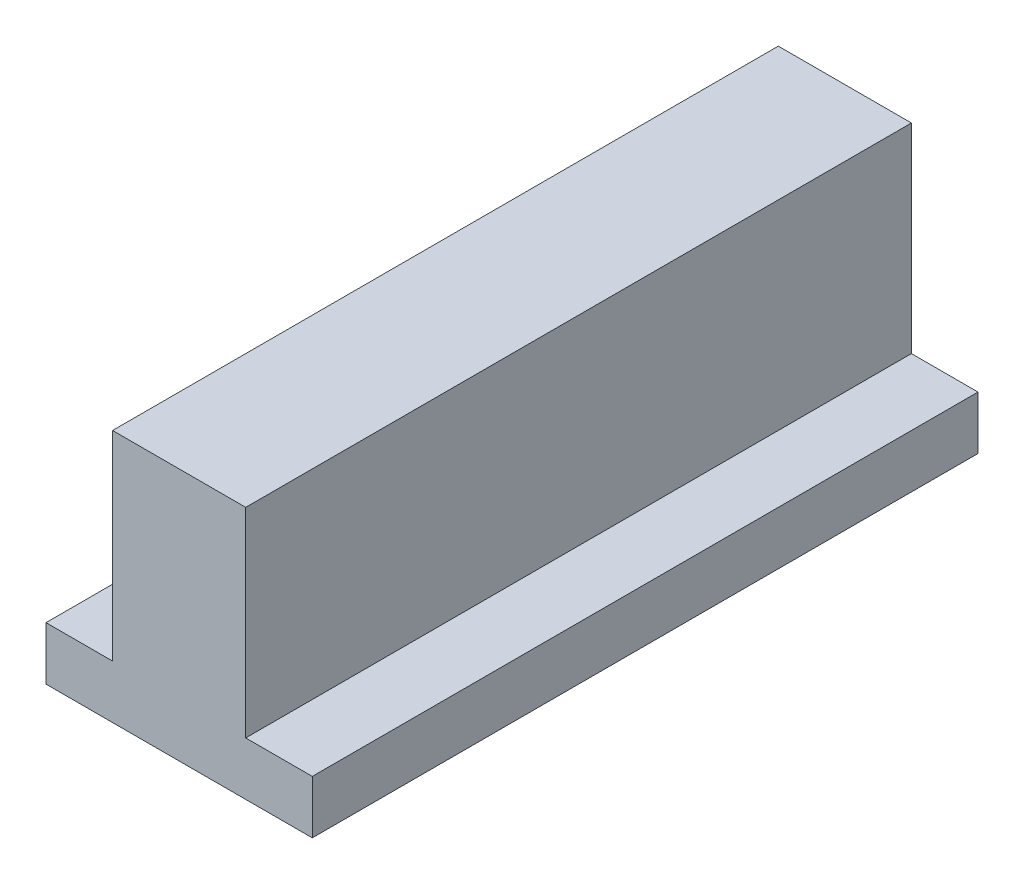
ISO-10303-21;
HEADER;
FILE_DESCRIPTION(('STEP AP214'),'2;1');
FILE_NAME('part.step','',(''),(''),'','','');
FILE_SCHEMA(('AUTOMOTIVE_DESIGN { 1 0 10303 214 1 1 1 1 }'));
ENDSEC;
DATA;
#1=APPLICATION_CONTEXT('core data for automotive mechanical design processes');
#2=APPLICATION_PROTOCOL_DEFINITION('international standard','automotive_design',2000,#1);
#3=PRODUCT_CONTEXT('',#1,'mechanical');
#4=PRODUCT('Part','Part','',(#3));
#5=PRODUCT_RELATED_PRODUCT_CATEGORY('part','',(#4));
#6=PRODUCT_DEFINITION_FORMATION('','',#4);
#7=PRODUCT_DEFINITION_CONTEXT('part definition',#1,'design');
#8=PRODUCT_DEFINITION('design','',#6,#7);
#9=PRODUCT_DEFINITION_SHAPE('','',#8);
#10=(LENGTH_UNIT() NAMED_UNIT(*) SI_UNIT(.MILLI.,.METRE.));
#11=(NAMED_UNIT(*) PLANE_ANGLE_UNIT() SI_UNIT($,.RADIAN.));
#12=(NAMED_UNIT(*) SI_UNIT($,.STERADIAN.) SOLID_ANGLE_UNIT());
#13=UNCERTAINTY_MEASURE_WITH_UNIT(LENGTH_MEASURE(1.E-05),#10,'distance_accuracy_value','');
#14=(GEOMETRIC_REPRESENTATION_CONTEXT(3) GLOBAL_UNCERTAINTY_ASSIGNED_CONTEXT((#13)) GLOBAL_UNIT_ASSIGNED_CONTEXT((#10,
#11,#12)) REPRESENTATION_CONTEXT('',''));
#15=CARTESIAN_POINT('',(0.,0.,0.));
#16=DIRECTION('',(0.,0.,1.));
#17=DIRECTION('',(1.,0.,0.));
#18=AXIS2_PLACEMENT_3D('',#15,#16,#17);
#19=CARTESIAN_POINT('',(-10.,0.,50.));
#20=DIRECTION('',(1.,0.,0.));
#21=DIRECTION('',(0.,1.,0.));
#22=AXIS2_PLACEMENT_3D('',#19,#20,#21);
#23=PLANE('',#22);
#24=DIRECTION('',(0.,-1.,0.));
#25=VECTOR('',#24,1.);
#26=CARTESIAN_POINT('',(-10.,0.,0.));
#27=LINE('',#26,#25);
#28=CARTESIAN_POINT('',(-10.0000000000001,4.,0.));
#29=VERTEX_POINT('',#28);
#30=CARTESIAN_POINT('',(-10.,0.,0.));
#31=VERTEX_POINT('',#30);
#32=EDGE_CURVE('E140',#29,#31,#27,.T.);
#33=ORIENTED_EDGE('',*,*,#32,.T.);
#34=DIRECTION('',(0.,0.,-1.));
#35=VECTOR('',#34,1.);
#36=CARTESIAN_POINT('',(-10.,0.,50.));
#37=LINE('',#36,#35);
#38=CARTESIAN_POINT('',(-10.,0.,50.));
#39=VERTEX_POINT('',#38);
#40=EDGE_CURVE('E11',#39,#31,#37,.T.);
#41=ORIENTED_EDGE('',*,*,#40,.F.);
#42=DIRECTION('',(0.,-1.,0.));
#43=VECTOR('',#42,1.);
#44=CARTESIAN_POINT('',(-10.,0.,50.));
#45=LINE('',#44,#43);
#46=CARTESIAN_POINT('',(-10.0000000000001,4.,50.));
#47=VERTEX_POINT('',#46);
#48=EDGE_CURVE('E163',#47,#39,#45,.T.);
#49=ORIENTED_EDGE('',*,*,#48,.F.);
#50=DIRECTION('',(0.,0.,-1.));
#51=VECTOR('',#50,1.);
#52=CARTESIAN_POINT('',(-10.0000000000001,4.,50.));
#53=LINE('',#52,#51);
#54=EDGE_CURVE('E136',#47,#29,#53,.T.);
#55=ORIENTED_EDGE('',*,*,#54,.T.);
#56=EDGE_LOOP('',(#33,#41,#49,#55));
#57=FACE_BOUND('',#56,.T.);
#58=ADVANCED_FACE('F39',(#57),#23,.F.);
#59=CARTESIAN_POINT('',(10.0000000000001,0.,50.));
#60=DIRECTION('',(0.,1.,0.));
#61=DIRECTION('',(-1.,0.,0.));
#62=AXIS2_PLACEMENT_3D('',#59,#60,#61);
#63=PLANE('',#62);
#64=DIRECTION('',(1.,0.,0.));
#65=VECTOR('',#64,1.);
#66=CARTESIAN_POINT('',(10.0000000000001,0.,0.));
#67=LINE('',#66,#65);
#68=CARTESIAN_POINT('',(10.0000000000001,0.,0.));
#69=VERTEX_POINT('',#68);
#70=EDGE_CURVE('E144',#31,#69,#67,.T.);
#71=ORIENTED_EDGE('',*,*,#70,.T.);
#72=DIRECTION('',(0.,0.,-1.));
#73=VECTOR('',#72,1.);
#74=CARTESIAN_POINT('',(10.0000000000001,0.,50.));
#75=LINE('',#74,#73);
#76=CARTESIAN_POINT('',(10.0000000000001,0.,50.));
#77=VERTEX_POINT('',#76);
#78=EDGE_CURVE('E48',#77,#69,#75,.T.);
#79=ORIENTED_EDGE('',*,*,#78,.F.);
#80=DIRECTION('',(1.,0.,0.));
#81=VECTOR('',#80,1.);
#82=CARTESIAN_POINT('',(10.0000000000001,0.,50.));
#83=LINE('',#82,#81);
#84=EDGE_CURVE('E98',#39,#77,#83,.T.);
#85=ORIENTED_EDGE('',*,*,#84,.F.);
#86=ORIENTED_EDGE('',*,*,#40,.T.);
#87=EDGE_LOOP('',(#71,#79,#85,#86));
#88=FACE_BOUND('',#87,.T.);
#89=ADVANCED_FACE('F208',(#88),#63,.F.);
#90=CARTESIAN_POINT('',(10.0000000000001,0.,50.));
#91=DIRECTION('',(-1.,0.,0.));
#92=DIRECTION('',(0.,-1.,0.));
#93=AXIS2_PLACEMENT_3D('',#90,#91,#92);
#94=PLANE('',#93);
#95=DIRECTION('',(0.,1.,0.));
#96=VECTOR('',#95,1.);
#97=CARTESIAN_POINT('',(10.0000000000001,0.,0.));
#98=LINE('',#97,#96);
#99=CARTESIAN_POINT('',(10.0000000000001,4.,0.));
#100=VERTEX_POINT('',#99);
#101=EDGE_CURVE('E147',#69,#100,#98,.T.);
#102=ORIENTED_EDGE('',*,*,#101,.T.);
#103=DIRECTION('',(0.,0.,-1.));
#104=VECTOR('',#103,1.);
#105=CARTESIAN_POINT('',(10.0000000000001,4.,50.));
#106=LINE('',#105,#104);
#107=CARTESIAN_POINT('',(10.0000000000001,4.,50.));
#108=VERTEX_POINT('',#107);
#109=EDGE_CURVE('E174',#108,#100,#106,.T.);
#110=ORIENTED_EDGE('',*,*,#109,.F.);
#111=DIRECTION('',(0.,1.,0.));
#112=VECTOR('',#111,1.);
#113=CARTESIAN_POINT('',(10.0000000000001,0.,50.));
#114=LINE('',#113,#112);
#115=EDGE_CURVE('E184',#77,#108,#114,.T.);
#116=ORIENTED_EDGE('',*,*,#115,.F.);
#117=ORIENTED_EDGE('',*,*,#78,.T.);
#118=EDGE_LOOP('',(#102,#110,#116,#117));
#119=FACE_BOUND('',#118,.T.);
#120=ADVANCED_FACE('F182',(#119),#94,.F.);
#121=CARTESIAN_POINT('',(10.0000000000001,4.,50.));
#122=DIRECTION('',(0.,-1.,0.));
#123=DIRECTION('',(0.,0.,-1.));
#124=AXIS2_PLACEMENT_3D('',#121,#122,#123);
#125=PLANE('',#124);
#126=DIRECTION('',(-1.,0.,0.));
#127=VECTOR('',#126,1.);
#128=CARTESIAN_POINT('',(10.0000000000001,4.,0.));
#129=LINE('',#128,#127);
#130=CARTESIAN_POINT('',(5.00000000000006,4.,0.));
#131=VERTEX_POINT('',#130);
#132=EDGE_CURVE('E150',#100,#131,#129,.T.);
#133=ORIENTED_EDGE('',*,*,#132,.T.);
#134=DIRECTION('',(0.,0.,-1.));
#135=VECTOR('',#134,1.);
#136=CARTESIAN_POINT('',(5.00000000000006,4.,50.));
#137=LINE('',#136,#135);
#138=CARTESIAN_POINT('',(5.00000000000006,4.,50.));
#139=VERTEX_POINT('',#138);
#140=EDGE_CURVE('E170',#139,#131,#137,.T.);
#141=ORIENTED_EDGE('',*,*,#140,.F.);
#142=DIRECTION('',(-1.,0.,0.));
#143=VECTOR('',#142,1.);
#144=CARTESIAN_POINT('',(10.0000000000001,4.,50.));
#145=LINE('',#144,#143);
#146=EDGE_CURVE('E196',#108,#139,#145,.T.);
#147=ORIENTED_EDGE('',*,*,#146,.F.);
#148=ORIENTED_EDGE('',*,*,#109,.T.);
#149=EDGE_LOOP('',(#133,#141,#147,#148));
#150=FACE_BOUND('',#149,.T.);
#151=ADVANCED_FACE('F191',(#150),#125,.F.);
#152=CARTESIAN_POINT('',(5.00000000000006,9.,50.));
#153=DIRECTION('',(-1.,0.,0.));
#154=DIRECTION('',(0.,-1.,0.));
#155=AXIS2_PLACEMENT_3D('',#152,#153,#154);
#156=PLANE('',#155);
#157=DIRECTION('',(0.,1.,0.));
#158=VECTOR('',#157,1.);
#159=CARTESIAN_POINT('',(5.00000000000006,9.,0.));
#160=LINE('',#159,#158);
#161=CARTESIAN_POINT('',(5.00000000000003,19.,0.));
#162=VERTEX_POINT('',#161);
#163=EDGE_CURVE('E154',#131,#162,#160,.T.);
#164=ORIENTED_EDGE('',*,*,#163,.T.);
#165=DIRECTION('',(0.,0.,-1.));
#166=VECTOR('',#165,1.);
#167=CARTESIAN_POINT('',(5.00000000000003,19.,50.));
#168=LINE('',#167,#166);
#169=CARTESIAN_POINT('',(5.00000000000003,19.,50.));
#170=VERTEX_POINT('',#169);
#171=EDGE_CURVE('E129',#170,#162,#168,.T.);
#172=ORIENTED_EDGE('',*,*,#171,.F.);
#173=DIRECTION('',(0.,1.,0.));
#174=VECTOR('',#173,1.);
#175=CARTESIAN_POINT('',(5.00000000000006,4.,50.));
#176=LINE('',#175,#174);
#177=EDGE_CURVE('E117',#139,#170,#176,.T.);
#178=ORIENTED_EDGE('',*,*,#177,.F.);
#179=ORIENTED_EDGE('',*,*,#140,.T.);
#180=EDGE_LOOP('',(#164,#172,#178,#179));
#181=FACE_BOUND('',#180,.T.);
#182=ADVANCED_FACE('F194',(#181),#156,.F.);
#183=CARTESIAN_POINT('',(5.00000000000003,19.,50.));
#184=DIRECTION('',(0.,-1.,0.));
#185=DIRECTION('',(1.,0.,0.));
#186=AXIS2_PLACEMENT_3D('',#183,#184,#185);
#187=PLANE('',#186);
#188=DIRECTION('',(-1.,0.,0.));
#189=VECTOR('',#188,1.);
#190=CARTESIAN_POINT('',(5.00000000000003,19.,0.));
#191=LINE('',#190,#189);
#192=CARTESIAN_POINT('',(-5.0000000000001,19.,0.));
#193=VERTEX_POINT('',#192);
#194=EDGE_CURVE('E127',#162,#193,#191,.T.);
#195=ORIENTED_EDGE('',*,*,#194,.T.);
#196=DIRECTION('',(0.,0.,-1.));
#197=VECTOR('',#196,1.);
#198=CARTESIAN_POINT('',(-5.0000000000001,19.,50.));
#199=LINE('',#198,#197);
#200=CARTESIAN_POINT('',(-5.0000000000001,19.,50.));
#201=VERTEX_POINT('',#200);
#202=EDGE_CURVE('E124',#201,#193,#199,.T.);
#203=ORIENTED_EDGE('',*,*,#202,.F.);
#204=DIRECTION('',(-1.,0.,0.));
#205=VECTOR('',#204,1.);
#206=CARTESIAN_POINT('',(5.00000000000003,19.,50.));
#207=LINE('',#206,#205);
#208=EDGE_CURVE('E111',#170,#201,#207,.T.);
#209=ORIENTED_EDGE('',*,*,#208,.F.);
#210=ORIENTED_EDGE('',*,*,#171,.T.);
#211=EDGE_LOOP('',(#195,#203,#209,#210));
#212=FACE_BOUND('',#211,.T.);
#213=ADVANCED_FACE('F125',(#212),#187,.F.);
#214=CARTESIAN_POINT('',(-5.00000000000006,4.,50.));
#215=DIRECTION('',(1.,0.,0.));
#216=DIRECTION('',(0.,1.,0.));
#217=AXIS2_PLACEMENT_3D('',#214,#215,#216);
#218=PLANE('',#217);
#219=DIRECTION('',(0.,-1.,0.));
#220=VECTOR('',#219,1.);
#221=CARTESIAN_POINT('',(-5.00000000000006,4.,0.));
#222=LINE('',#221,#220);
#223=CARTESIAN_POINT('',(-5.00000000000006,4.,0.));
#224=VERTEX_POINT('',#223);
#225=EDGE_CURVE('E84',#193,#224,#222,.T.);
#226=ORIENTED_EDGE('',*,*,#225,.T.);
#227=DIRECTION('',(0.,0.,-1.));
#228=VECTOR('',#227,1.);
#229=CARTESIAN_POINT('',(-5.00000000000006,4.,50.));
#230=LINE('',#229,#228);
#231=CARTESIAN_POINT('',(-5.00000000000006,4.,50.));
#232=VERTEX_POINT('',#231);
#233=EDGE_CURVE('E130',#232,#224,#230,.T.);
#234=ORIENTED_EDGE('',*,*,#233,.F.);
#235=DIRECTION('',(0.,-1.,0.));
#236=VECTOR('',#235,1.);
#237=CARTESIAN_POINT('',(-5.00000000000006,8.99999999999999,50.));
#238=LINE('',#237,#236);
#239=EDGE_CURVE('E115',#201,#232,#238,.T.);
#240=ORIENTED_EDGE('',*,*,#239,.F.);
#241=ORIENTED_EDGE('',*,*,#202,.T.);
#242=EDGE_LOOP('',(#226,#234,#240,#241));
#243=FACE_BOUND('',#242,.T.);
#244=ADVANCED_FACE('F132',(#243),#218,.F.);
#245=CARTESIAN_POINT('',(-10.0000000000001,4.,50.));
#246=DIRECTION('',(0.,-1.,0.));
#247=DIRECTION('',(0.,0.,-1.));
#248=AXIS2_PLACEMENT_3D('',#245,#246,#247);
#249=PLANE('',#248);
#250=DIRECTION('',(-1.,0.,0.));
#251=VECTOR('',#250,1.);
#252=CARTESIAN_POINT('',(-10.0000000000001,4.,0.));
#253=LINE('',#252,#251);
#254=EDGE_CURVE('E90',#224,#29,#253,.T.);
#255=ORIENTED_EDGE('',*,*,#254,.T.);
#256=ORIENTED_EDGE('',*,*,#54,.F.);
#257=DIRECTION('',(-1.,0.,0.));
#258=VECTOR('',#257,1.);
#259=CARTESIAN_POINT('',(-10.0000000000001,4.,50.));
#260=LINE('',#259,#258);
#261=EDGE_CURVE('E56',#232,#47,#260,.T.);
#262=ORIENTED_EDGE('',*,*,#261,.F.);
#263=ORIENTED_EDGE('',*,*,#233,.T.);
#264=EDGE_LOOP('',(#255,#256,#262,#263));
#265=FACE_BOUND('',#264,.T.);
#266=ADVANCED_FACE('F224',(#265),#249,.F.);
#267=CARTESIAN_POINT('',(0.,0.,50.));
#268=DIRECTION('',(0.,0.,-1.));
#269=DIRECTION('',(-1.,0.,0.));
#270=AXIS2_PLACEMENT_3D('',#267,#268,#269);
#271=PLANE('',#270);
#272=ORIENTED_EDGE('',*,*,#48,.T.);
#273=ORIENTED_EDGE('',*,*,#84,.T.);
#274=ORIENTED_EDGE('',*,*,#115,.T.);
#275=ORIENTED_EDGE('',*,*,#146,.T.);
#276=ORIENTED_EDGE('',*,*,#177,.T.);
#277=ORIENTED_EDGE('',*,*,#208,.T.);
#278=ORIENTED_EDGE('',*,*,#239,.T.);
#279=ORIENTED_EDGE('',*,*,#261,.T.);
#280=EDGE_LOOP('',(#272,#273,#274,#275,#276,#277,#278,#279));
#281=FACE_BOUND('',#280,.T.);
#282=ADVANCED_FACE('F113',(#281),#271,.F.);
#283=CARTESIAN_POINT('',(0.,0.,0.));
#284=DIRECTION('',(0.,0.,-1.));
#285=DIRECTION('',(-1.,0.,0.));
#286=AXIS2_PLACEMENT_3D('',#283,#284,#285);
#287=PLANE('',#286);
#288=ORIENTED_EDGE('',*,*,#32,.F.);
#289=ORIENTED_EDGE('',*,*,#254,.F.);
#290=ORIENTED_EDGE('',*,*,#225,.F.);
#291=ORIENTED_EDGE('',*,*,#194,.F.);
#292=ORIENTED_EDGE('',*,*,#163,.F.);
#293=ORIENTED_EDGE('',*,*,#132,.F.);
#294=ORIENTED_EDGE('',*,*,#101,.F.);
#295=ORIENTED_EDGE('',*,*,#70,.F.);
#296=EDGE_LOOP('',(#288,#289,#290,#291,#292,#293,#294,#295));
#297=FACE_BOUND('',#296,.T.);
#298=ADVANCED_FACE('F188',(#297),#287,.T.);
#299=CLOSED_SHELL('',(#58,#89,#120,#151,#182,#213,#244,#266,#282,#298));
#300=MANIFOLD_SOLID_BREP('B2',#299);
#301=ADVANCED_BREP_SHAPE_REPRESENTATION('',(#18,#300),#14);
#302=SHAPE_DEFINITION_REPRESENTATION(#9,#301);
ENDSEC;
END-ISO-10303-21;
